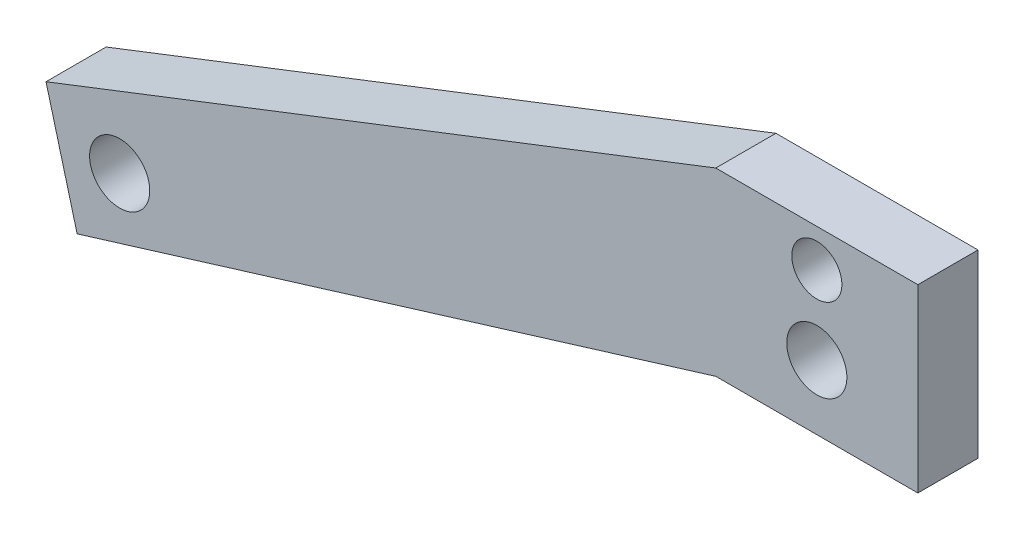
ISO-10303-21;
HEADER;
FILE_DESCRIPTION(('STEP AP214'),'2;1');
FILE_NAME('part.step','',(''),(''),'','','');
FILE_SCHEMA(('AUTOMOTIVE_DESIGN { 1 0 10303 214 1 1 1 1 }'));
ENDSEC;
DATA;
#1=APPLICATION_CONTEXT('core data for automotive mechanical design processes');
#2=APPLICATION_PROTOCOL_DEFINITION('international standard','automotive_design',2000,#1);
#3=PRODUCT_CONTEXT('',#1,'mechanical');
#4=PRODUCT('Part','Part','',(#3));
#5=PRODUCT_RELATED_PRODUCT_CATEGORY('part','',(#4));
#6=PRODUCT_DEFINITION_FORMATION('','',#4);
#7=PRODUCT_DEFINITION_CONTEXT('part definition',#1,'design');
#8=PRODUCT_DEFINITION('design','',#6,#7);
#9=PRODUCT_DEFINITION_SHAPE('','',#8);
#10=(LENGTH_UNIT() NAMED_UNIT(*) SI_UNIT(.MILLI.,.METRE.));
#11=(NAMED_UNIT(*) PLANE_ANGLE_UNIT() SI_UNIT($,.RADIAN.));
#12=(NAMED_UNIT(*) SI_UNIT($,.STERADIAN.) SOLID_ANGLE_UNIT());
#13=UNCERTAINTY_MEASURE_WITH_UNIT(LENGTH_MEASURE(1.E-05),#10,'distance_accuracy_value','');
#14=(GEOMETRIC_REPRESENTATION_CONTEXT(3) GLOBAL_UNCERTAINTY_ASSIGNED_CONTEXT((#13)) GLOBAL_UNIT_ASSIGNED_CONTEXT((#10,
#11,#12)) REPRESENTATION_CONTEXT('',''));
#15=CARTESIAN_POINT('',(0.,0.,0.));
#16=DIRECTION('',(0.,0.,1.));
#17=DIRECTION('',(1.,0.,0.));
#18=AXIS2_PLACEMENT_3D('',#15,#16,#17);
#19=CARTESIAN_POINT('',(-112.94386701194,-30.2632179558976,9.525));
#20=DIRECTION('',(-0.965925826289068,-0.258819045102522,0.));
#21=DIRECTION('',(0.258819045102522,-0.965925826289068,0.));
#22=AXIS2_PLACEMENT_3D('',#19,#20,#21);
#23=PLANE('',#22);
#24=DIRECTION('',(-0.258819045102522,0.965925826289068,0.));
#25=VECTOR('',#24,1.);
#26=CARTESIAN_POINT('',(-112.94386701194,-30.2632179558976,0.));
#27=LINE('',#26,#25);
#28=CARTESIAN_POINT('',(-117.140508662759,-14.6011380938817,0.));
#29=VERTEX_POINT('',#28);
#30=CARTESIAN_POINT('',(-122.071011471962,3.79974889692507,0.));
#31=VERTEX_POINT('',#30);
#32=EDGE_CURVE('E144',#29,#31,#27,.T.);
#33=ORIENTED_EDGE('',*,*,#32,.F.);
#34=DIRECTION('',(0.,0.,-1.));
#35=VECTOR('',#34,1.);
#36=CARTESIAN_POINT('',(-117.140508662759,-14.6011380938817,9.525));
#37=LINE('',#36,#35);
#38=CARTESIAN_POINT('',(-117.140508662759,-14.6011380938817,9.525));
#39=VERTEX_POINT('',#38);
#40=EDGE_CURVE('E11',#39,#29,#37,.T.);
#41=ORIENTED_EDGE('',*,*,#40,.F.);
#42=DIRECTION('',(-0.258819045102522,0.965925826289068,0.));
#43=VECTOR('',#42,1.);
#44=CARTESIAN_POINT('',(-112.94386701194,-30.2632179558976,9.525));
#45=LINE('',#44,#43);
#46=CARTESIAN_POINT('',(-122.071011471962,3.79974889692507,9.525));
#47=VERTEX_POINT('',#46);
#48=EDGE_CURVE('E278',#39,#47,#45,.T.);
#49=ORIENTED_EDGE('',*,*,#48,.T.);
#50=DIRECTION('',(0.,0.,-1.));
#51=VECTOR('',#50,1.);
#52=CARTESIAN_POINT('',(-122.071011471962,3.79974889692507,9.525));
#53=LINE('',#52,#51);
#54=EDGE_CURVE('E87',#47,#31,#53,.T.);
#55=ORIENTED_EDGE('',*,*,#54,.T.);
#56=EDGE_LOOP('',(#33,#41,#49,#55));
#57=FACE_BOUND('',#56,.T.);
#58=ADVANCED_FACE('F41',(#57),#23,.T.);
#59=CARTESIAN_POINT('',(-5.98135295090197,19.4983199682038,9.525));
#60=DIRECTION('',(0.293273680623719,-0.956028528995561,0.));
#61=DIRECTION('',(0.956028528995562,0.293273680623719,0.));
#62=AXIS2_PLACEMENT_3D('',#59,#60,#61);
#63=PLANE('',#62);
#64=DIRECTION('',(-0.956028528995561,-0.293273680623719,0.));
#65=VECTOR('',#64,1.);
#66=CARTESIAN_POINT('',(-5.98135295090197,19.4983199682038,0.));
#67=LINE('',#66,#65);
#68=CARTESIAN_POINT('',(-15.9999946249734,16.4249766217535,0.));
#69=VERTEX_POINT('',#68);
#70=EDGE_CURVE('E141',#69,#29,#67,.T.);
#71=ORIENTED_EDGE('',*,*,#70,.F.);
#72=DIRECTION('',(0.,0.,-1.));
#73=VECTOR('',#72,1.);
#74=CARTESIAN_POINT('',(-15.9999946249734,16.4249766217535,9.525));
#75=LINE('',#74,#73);
#76=CARTESIAN_POINT('',(-15.9999946249734,16.4249766217535,9.525));
#77=VERTEX_POINT('',#76);
#78=EDGE_CURVE('E51',#77,#69,#75,.T.);
#79=ORIENTED_EDGE('',*,*,#78,.F.);
#80=DIRECTION('',(-0.956028528995561,-0.293273680623719,0.));
#81=VECTOR('',#80,1.);
#82=CARTESIAN_POINT('',(-5.98135295090197,19.4983199682038,9.525));
#83=LINE('',#82,#81);
#84=EDGE_CURVE('E280',#77,#39,#83,.T.);
#85=ORIENTED_EDGE('',*,*,#84,.T.);
#86=ORIENTED_EDGE('',*,*,#40,.T.);
#87=EDGE_LOOP('',(#71,#79,#85,#86));
#88=FACE_BOUND('',#87,.T.);
#89=ADVANCED_FACE('F142',(#88),#63,.T.);
#90=CARTESIAN_POINT('',(0.,16.4249766217535,9.525));
#91=DIRECTION('',(0.,-1.,0.));
#92=DIRECTION('',(1.,0.,0.));
#93=AXIS2_PLACEMENT_3D('',#90,#91,#92);
#94=PLANE('',#93);
#95=DIRECTION('',(-1.,0.,0.));
#96=VECTOR('',#95,1.);
#97=CARTESIAN_POINT('',(0.,16.4249766217535,0.));
#98=LINE('',#97,#96);
#99=CARTESIAN_POINT('',(16.0000053750267,16.4249766217535,0.));
#100=VERTEX_POINT('',#99);
#101=EDGE_CURVE('E137',#100,#69,#98,.T.);
#102=ORIENTED_EDGE('',*,*,#101,.F.);
#103=DIRECTION('',(0.,0.,-1.));
#104=VECTOR('',#103,1.);
#105=CARTESIAN_POINT('',(16.0000053750267,16.4249766217535,9.525));
#106=LINE('',#105,#104);
#107=CARTESIAN_POINT('',(16.0000053750267,16.4249766217535,9.525));
#108=VERTEX_POINT('',#107);
#109=EDGE_CURVE('E124',#108,#100,#106,.T.);
#110=ORIENTED_EDGE('',*,*,#109,.F.);
#111=DIRECTION('',(-1.,0.,0.));
#112=VECTOR('',#111,1.);
#113=CARTESIAN_POINT('',(0.,16.4249766217535,9.525));
#114=LINE('',#113,#112);
#115=EDGE_CURVE('E116',#108,#77,#114,.T.);
#116=ORIENTED_EDGE('',*,*,#115,.T.);
#117=ORIENTED_EDGE('',*,*,#78,.T.);
#118=EDGE_LOOP('',(#102,#110,#116,#117));
#119=FACE_BOUND('',#118,.T.);
#120=ADVANCED_FACE('F135',(#119),#94,.T.);
#121=CARTESIAN_POINT('',(16.0000053750267,0.,9.525));
#122=DIRECTION('',(-1.,0.,0.));
#123=DIRECTION('',(0.,0.,1.));
#124=AXIS2_PLACEMENT_3D('',#121,#122,#123);
#125=PLANE('',#124);
#126=DIRECTION('',(0.,1.,0.));
#127=VECTOR('',#126,1.);
#128=CARTESIAN_POINT('',(16.0000053750267,0.,0.));
#129=LINE('',#128,#127);
#130=CARTESIAN_POINT('',(16.0000053750267,44.9999766217537,0.));
#131=VERTEX_POINT('',#130);
#132=EDGE_CURVE('E122',#100,#131,#129,.T.);
#133=ORIENTED_EDGE('',*,*,#132,.T.);
#134=DIRECTION('',(0.,0.,-1.));
#135=VECTOR('',#134,1.);
#136=CARTESIAN_POINT('',(16.0000053750267,44.9999766217537,9.525));
#137=LINE('',#136,#135);
#138=CARTESIAN_POINT('',(16.0000053750267,44.9999766217537,9.525));
#139=VERTEX_POINT('',#138);
#140=EDGE_CURVE('E105',#139,#131,#137,.T.);
#141=ORIENTED_EDGE('',*,*,#140,.F.);
#142=DIRECTION('',(0.,1.,0.));
#143=VECTOR('',#142,1.);
#144=CARTESIAN_POINT('',(16.0000053750267,0.,9.525));
#145=LINE('',#144,#143);
#146=EDGE_CURVE('E109',#108,#139,#145,.T.);
#147=ORIENTED_EDGE('',*,*,#146,.F.);
#148=ORIENTED_EDGE('',*,*,#109,.T.);
#149=EDGE_LOOP('',(#133,#141,#147,#148));
#150=FACE_BOUND('',#149,.T.);
#151=ADVANCED_FACE('F120',(#150),#125,.F.);
#152=CARTESIAN_POINT('',(0.,44.9999766217537,9.525));
#153=DIRECTION('',(0.,-1.,0.));
#154=DIRECTION('',(1.,0.,0.));
#155=AXIS2_PLACEMENT_3D('',#152,#153,#154);
#156=PLANE('',#155);
#157=DIRECTION('',(-1.,0.,0.));
#158=VECTOR('',#157,1.);
#159=CARTESIAN_POINT('',(0.,44.9999766217537,0.));
#160=LINE('',#159,#158);
#161=CARTESIAN_POINT('',(-15.9999946249733,44.9999766217537,0.));
#162=VERTEX_POINT('',#161);
#163=EDGE_CURVE('E150',#131,#162,#160,.T.);
#164=ORIENTED_EDGE('',*,*,#163,.T.);
#165=DIRECTION('',(0.,0.,-1.));
#166=VECTOR('',#165,1.);
#167=CARTESIAN_POINT('',(-15.9999946249733,44.9999766217537,9.525));
#168=LINE('',#167,#166);
#169=CARTESIAN_POINT('',(-15.9999946249733,44.9999766217537,9.525));
#170=VERTEX_POINT('',#169);
#171=EDGE_CURVE('E107',#170,#162,#168,.T.);
#172=ORIENTED_EDGE('',*,*,#171,.F.);
#173=DIRECTION('',(-1.,0.,0.));
#174=VECTOR('',#173,1.);
#175=CARTESIAN_POINT('',(0.,44.9999766217537,9.525));
#176=LINE('',#175,#174);
#177=EDGE_CURVE('E100',#139,#170,#176,.T.);
#178=ORIENTED_EDGE('',*,*,#177,.F.);
#179=ORIENTED_EDGE('',*,*,#140,.T.);
#180=EDGE_LOOP('',(#164,#172,#178,#179));
#181=FACE_BOUND('',#180,.T.);
#182=ADVANCED_FACE('F103',(#181),#156,.F.);
#183=CARTESIAN_POINT('',(5.37502667774858E-06,38.9999766217537,9.525));
#184=DIRECTION('',(0.,0.,-1.));
#185=DIRECTION('',(-1.,0.,0.));
#186=AXIS2_PLACEMENT_3D('',#183,#184,#185);
#187=CYLINDRICAL_SURFACE('',#186,3.96875000000003);
#188=CARTESIAN_POINT('',(5.37502667774858E-06,38.9999766217537,9.525));
#189=DIRECTION('',(0.,0.,1.));
#190=DIRECTION('',(1.,0.,0.));
#191=AXIS2_PLACEMENT_3D('',#188,#189,#190);
#192=CIRCLE('',#191,3.96875000000003);
#193=CARTESIAN_POINT('',(3.96875537502671,38.9999766217537,9.525));
#194=VERTEX_POINT('',#193);
#195=EDGE_CURVE('E281',#194,#194,#192,.T.);
#196=ORIENTED_EDGE('',*,*,#195,.T.);
#197=EDGE_LOOP('',(#196));
#198=FACE_BOUND('',#197,.T.);
#199=CARTESIAN_POINT('',(5.37502667774858E-06,38.9999766217537,0.));
#200=DIRECTION('',(0.,0.,1.));
#201=DIRECTION('',(1.,0.,0.));
#202=AXIS2_PLACEMENT_3D('',#199,#200,#201);
#203=CIRCLE('',#202,3.96875000000003);
#204=CARTESIAN_POINT('',(3.96875537502671,38.9999766217537,0.));
#205=VERTEX_POINT('',#204);
#206=EDGE_CURVE('E170',#205,#205,#203,.T.);
#207=ORIENTED_EDGE('',*,*,#206,.F.);
#208=EDGE_LOOP('',(#207));
#209=FACE_BOUND('',#208,.T.);
#210=ADVANCED_FACE('F182',(#198,#209),#187,.F.);
#211=CARTESIAN_POINT('',(5.37288344110848E-06,26.6475736613415,9.525));
#212=DIRECTION('',(0.,0.,-1.));
#213=DIRECTION('',(-1.,0.,0.));
#214=AXIS2_PLACEMENT_3D('',#211,#212,#213);
#215=CYLINDRICAL_SURFACE('',#214,4.76250000381194);
#216=CARTESIAN_POINT('',(5.37288344110848E-06,26.6475736613415,9.525));
#217=DIRECTION('',(0.,0.,1.));
#218=DIRECTION('',(1.,0.,0.));
#219=AXIS2_PLACEMENT_3D('',#216,#217,#218);
#220=CIRCLE('',#219,4.76250000381194);
#221=CARTESIAN_POINT('',(4.76250537669538,26.6475736613415,9.525));
#222=VERTEX_POINT('',#221);
#223=EDGE_CURVE('E196',#222,#222,#220,.T.);
#224=ORIENTED_EDGE('',*,*,#223,.T.);
#225=EDGE_LOOP('',(#224));
#226=FACE_BOUND('',#225,.T.);
#227=CARTESIAN_POINT('',(5.37288344110848E-06,26.6475736613415,0.));
#228=DIRECTION('',(0.,0.,1.));
#229=DIRECTION('',(1.,0.,0.));
#230=AXIS2_PLACEMENT_3D('',#227,#228,#229);
#231=CIRCLE('',#230,4.76250000381194);
#232=CARTESIAN_POINT('',(4.76250537669538,26.6475736613415,0.));
#233=VERTEX_POINT('',#232);
#234=EDGE_CURVE('E166',#233,#233,#231,.T.);
#235=ORIENTED_EDGE('',*,*,#234,.F.);
#236=EDGE_LOOP('',(#235));
#237=FACE_BOUND('',#236,.T.);
#238=ADVANCED_FACE('F184',(#226,#237),#215,.F.);
#239=CARTESIAN_POINT('',(-110.405316571957,-2.93544319387677,9.525));
#240=DIRECTION('',(0.,0.,-1.));
#241=DIRECTION('',(-1.,0.,0.));
#242=AXIS2_PLACEMENT_3D('',#239,#240,#241);
#243=CYLINDRICAL_SURFACE('',#242,4.76250000381195);
#244=CARTESIAN_POINT('',(-110.405316571957,-2.93544319387677,9.525));
#245=DIRECTION('',(0.,0.,1.));
#246=DIRECTION('',(1.,0.,0.));
#247=AXIS2_PLACEMENT_3D('',#244,#245,#246);
#248=CIRCLE('',#247,4.76250000381195);
#249=CARTESIAN_POINT('',(-105.642816568145,-2.93544319387677,9.525));
#250=VERTEX_POINT('',#249);
#251=EDGE_CURVE('E157',#250,#250,#248,.T.);
#252=ORIENTED_EDGE('',*,*,#251,.T.);
#253=EDGE_LOOP('',(#252));
#254=FACE_BOUND('',#253,.T.);
#255=CARTESIAN_POINT('',(-110.405316571957,-2.93544319387677,0.));
#256=DIRECTION('',(0.,0.,1.));
#257=DIRECTION('',(1.,0.,0.));
#258=AXIS2_PLACEMENT_3D('',#255,#256,#257);
#259=CIRCLE('',#258,4.76250000381195);
#260=CARTESIAN_POINT('',(-105.642816568145,-2.93544319387677,0.));
#261=VERTEX_POINT('',#260);
#262=EDGE_CURVE('E162',#261,#261,#259,.T.);
#263=ORIENTED_EDGE('',*,*,#262,.F.);
#264=EDGE_LOOP('',(#263));
#265=FACE_BOUND('',#264,.T.);
#266=ADVANCED_FACE('F43',(#254,#265),#243,.F.);
#267=CARTESIAN_POINT('',(-17.2850636116905,44.5008286313914,9.525));
#268=DIRECTION('',(0.362067514703561,-0.932151873246193,0.));
#269=DIRECTION('',(0.932151873246193,0.362067514703561,0.));
#270=AXIS2_PLACEMENT_3D('',#267,#268,#269);
#271=PLANE('',#270);
#272=DIRECTION('',(-0.932151873246193,-0.362067514703561,0.));
#273=VECTOR('',#272,1.);
#274=CARTESIAN_POINT('',(-17.2850636116905,44.5008286313914,0.));
#275=LINE('',#274,#273);
#276=EDGE_CURVE('E80',#162,#31,#275,.T.);
#277=ORIENTED_EDGE('',*,*,#276,.T.);
#278=ORIENTED_EDGE('',*,*,#54,.F.);
#279=DIRECTION('',(-0.932151873246193,-0.362067514703561,0.));
#280=VECTOR('',#279,1.);
#281=CARTESIAN_POINT('',(-17.2850636116905,44.5008286313914,9.525));
#282=LINE('',#281,#280);
#283=EDGE_CURVE('E59',#170,#47,#282,.T.);
#284=ORIENTED_EDGE('',*,*,#283,.F.);
#285=ORIENTED_EDGE('',*,*,#171,.T.);
#286=EDGE_LOOP('',(#277,#278,#284,#285));
#287=FACE_BOUND('',#286,.T.);
#288=ADVANCED_FACE('F191',(#287),#271,.F.);
#289=CARTESIAN_POINT('',(0.,0.,9.525));
#290=DIRECTION('',(0.,0.,1.));
#291=DIRECTION('',(1.,0.,0.));
#292=AXIS2_PLACEMENT_3D('',#289,#290,#291);
#293=PLANE('',#292);
#294=ORIENTED_EDGE('',*,*,#251,.F.);
#295=EDGE_LOOP('',(#294));
#296=FACE_BOUND('',#295,.T.);
#297=ORIENTED_EDGE('',*,*,#223,.F.);
#298=EDGE_LOOP('',(#297));
#299=FACE_BOUND('',#298,.T.);
#300=ORIENTED_EDGE('',*,*,#195,.F.);
#301=EDGE_LOOP('',(#300));
#302=FACE_BOUND('',#301,.T.);
#303=ORIENTED_EDGE('',*,*,#48,.F.);
#304=ORIENTED_EDGE('',*,*,#84,.F.);
#305=ORIENTED_EDGE('',*,*,#115,.F.);
#306=ORIENTED_EDGE('',*,*,#146,.T.);
#307=ORIENTED_EDGE('',*,*,#177,.T.);
#308=ORIENTED_EDGE('',*,*,#283,.T.);
#309=EDGE_LOOP('',(#303,#304,#305,#306,#307,#308));
#310=FACE_BOUND('',#309,.T.);
#311=ADVANCED_FACE('F113',(#296,#299,#302,#310),#293,.T.);
#312=CARTESIAN_POINT('',(0.,0.,0.));
#313=DIRECTION('',(0.,0.,1.));
#314=DIRECTION('',(1.,0.,0.));
#315=AXIS2_PLACEMENT_3D('',#312,#313,#314);
#316=PLANE('',#315);
#317=ORIENTED_EDGE('',*,*,#262,.T.);
#318=EDGE_LOOP('',(#317));
#319=FACE_BOUND('',#318,.T.);
#320=ORIENTED_EDGE('',*,*,#234,.T.);
#321=EDGE_LOOP('',(#320));
#322=FACE_BOUND('',#321,.T.);
#323=ORIENTED_EDGE('',*,*,#206,.T.);
#324=EDGE_LOOP('',(#323));
#325=FACE_BOUND('',#324,.T.);
#326=ORIENTED_EDGE('',*,*,#32,.T.);
#327=ORIENTED_EDGE('',*,*,#276,.F.);
#328=ORIENTED_EDGE('',*,*,#163,.F.);
#329=ORIENTED_EDGE('',*,*,#132,.F.);
#330=ORIENTED_EDGE('',*,*,#101,.T.);
#331=ORIENTED_EDGE('',*,*,#70,.T.);
#332=EDGE_LOOP('',(#326,#327,#328,#329,#330,#331));
#333=FACE_BOUND('',#332,.T.);
#334=ADVANCED_FACE('F146',(#319,#322,#325,#333),#316,.F.);
#335=CLOSED_SHELL('',(#58,#89,#120,#151,#182,#210,#238,#266,#288,#311,#334));
#336=MANIFOLD_SOLID_BREP('B2',#335);
#337=ADVANCED_BREP_SHAPE_REPRESENTATION('',(#18,#336),#14);
#338=SHAPE_DEFINITION_REPRESENTATION(#9,#337);
ENDSEC;
END-ISO-10303-21;
